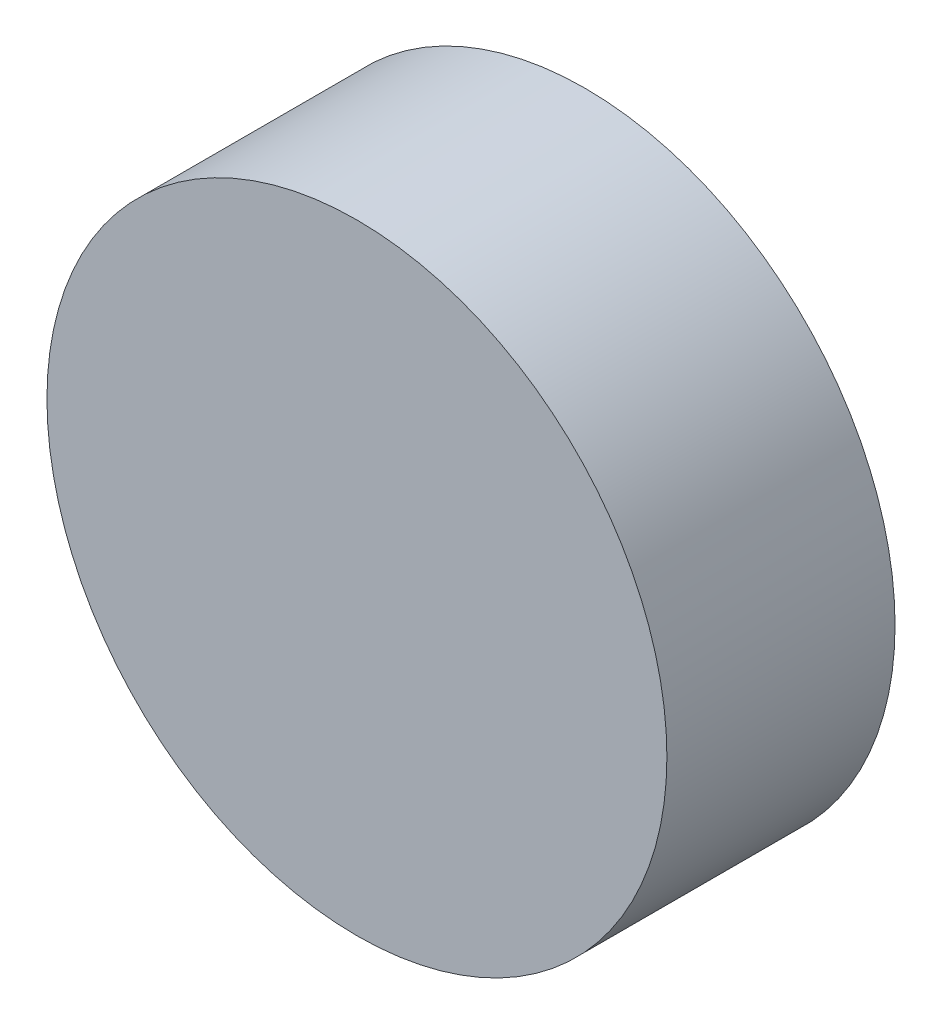
ISO-10303-21;
HEADER;
FILE_DESCRIPTION(('STEP AP214'),'2;1');
FILE_NAME('part.step','',(''),(''),'','','');
FILE_SCHEMA(('AUTOMOTIVE_DESIGN { 1 0 10303 214 1 1 1 1 }'));
ENDSEC;
DATA;
#1=APPLICATION_CONTEXT('core data for automotive mechanical design processes');
#2=APPLICATION_PROTOCOL_DEFINITION('international standard','automotive_design',2000,#1);
#3=PRODUCT_CONTEXT('',#1,'mechanical');
#4=PRODUCT('Part','Part','',(#3));
#5=PRODUCT_RELATED_PRODUCT_CATEGORY('part','',(#4));
#6=PRODUCT_DEFINITION_FORMATION('','',#4);
#7=PRODUCT_DEFINITION_CONTEXT('part definition',#1,'design');
#8=PRODUCT_DEFINITION('design','',#6,#7);
#9=PRODUCT_DEFINITION_SHAPE('','',#8);
#10=(LENGTH_UNIT() NAMED_UNIT(*) SI_UNIT(.MILLI.,.METRE.));
#11=(NAMED_UNIT(*) PLANE_ANGLE_UNIT() SI_UNIT($,.RADIAN.));
#12=(NAMED_UNIT(*) SI_UNIT($,.STERADIAN.) SOLID_ANGLE_UNIT());
#13=UNCERTAINTY_MEASURE_WITH_UNIT(LENGTH_MEASURE(1.E-05),#10,'distance_accuracy_value','');
#14=(GEOMETRIC_REPRESENTATION_CONTEXT(3) GLOBAL_UNCERTAINTY_ASSIGNED_CONTEXT((#13)) GLOBAL_UNIT_ASSIGNED_CONTEXT((#10,
#11,#12)) REPRESENTATION_CONTEXT('',''));
#15=CARTESIAN_POINT('',(0.,0.,0.));
#16=DIRECTION('',(0.,0.,1.));
#17=DIRECTION('',(1.,0.,0.));
#18=AXIS2_PLACEMENT_3D('',#15,#16,#17);
#19=CARTESIAN_POINT('',(-128.293417664124,-1.50338434199337,35.052));
#20=DIRECTION('',(0.,0.,-1.));
#21=DIRECTION('',(-1.,0.,0.));
#22=AXIS2_PLACEMENT_3D('',#19,#20,#21);
#23=CYLINDRICAL_SURFACE('',#22,47.625);
#24=CARTESIAN_POINT('',(-128.293417664124,-1.50338434199337,35.052));
#25=DIRECTION('',(0.,0.,1.));
#26=DIRECTION('',(1.,0.,0.));
#27=AXIS2_PLACEMENT_3D('',#24,#25,#26);
#28=CIRCLE('',#27,47.625);
#29=CARTESIAN_POINT('',(-80.6684176641243,-1.50338434199337,35.052));
#30=VERTEX_POINT('',#29);
#31=EDGE_CURVE('E10',#30,#30,#28,.T.);
#32=ORIENTED_EDGE('',*,*,#31,.F.);
#33=EDGE_LOOP('',(#32));
#34=FACE_BOUND('',#33,.T.);
#35=CARTESIAN_POINT('',(-128.293417664124,-1.50338434199337,0.));
#36=DIRECTION('',(0.,0.,1.));
#37=DIRECTION('',(1.,0.,0.));
#38=AXIS2_PLACEMENT_3D('',#35,#36,#37);
#39=CIRCLE('',#38,47.625);
#40=CARTESIAN_POINT('',(-80.6684176641243,-1.50338434199337,0.));
#41=VERTEX_POINT('',#40);
#42=EDGE_CURVE('E40',#41,#41,#39,.T.);
#43=ORIENTED_EDGE('',*,*,#42,.T.);
#44=EDGE_LOOP('',(#43));
#45=FACE_BOUND('',#44,.T.);
#46=ADVANCED_FACE('F37',(#34,#45),#23,.T.);
#47=CARTESIAN_POINT('',(-128.293417664124,-1.50338434199337,35.052));
#48=DIRECTION('',(0.,0.,1.));
#49=DIRECTION('',(1.,0.,0.));
#50=AXIS2_PLACEMENT_3D('',#47,#48,#49);
#51=PLANE('',#50);
#52=ORIENTED_EDGE('',*,*,#31,.T.);
#53=EDGE_LOOP('',(#52));
#54=FACE_BOUND('',#53,.T.);
#55=ADVANCED_FACE('F54',(#54),#51,.T.);
#56=CARTESIAN_POINT('',(-128.293417664124,-1.50338434199337,0.));
#57=DIRECTION('',(0.,0.,1.));
#58=DIRECTION('',(1.,0.,0.));
#59=AXIS2_PLACEMENT_3D('',#56,#57,#58);
#60=PLANE('',#59);
#61=ORIENTED_EDGE('',*,*,#42,.F.);
#62=EDGE_LOOP('',(#61));
#63=FACE_BOUND('',#62,.T.);
#64=ADVANCED_FACE('F52',(#63),#60,.F.);
#65=CLOSED_SHELL('',(#46,#55,#64));
#66=MANIFOLD_SOLID_BREP('B2',#65);
#67=ADVANCED_BREP_SHAPE_REPRESENTATION('',(#18,#66),#14);
#68=SHAPE_DEFINITION_REPRESENTATION(#9,#67);
ENDSEC;
END-ISO-10303-21;
